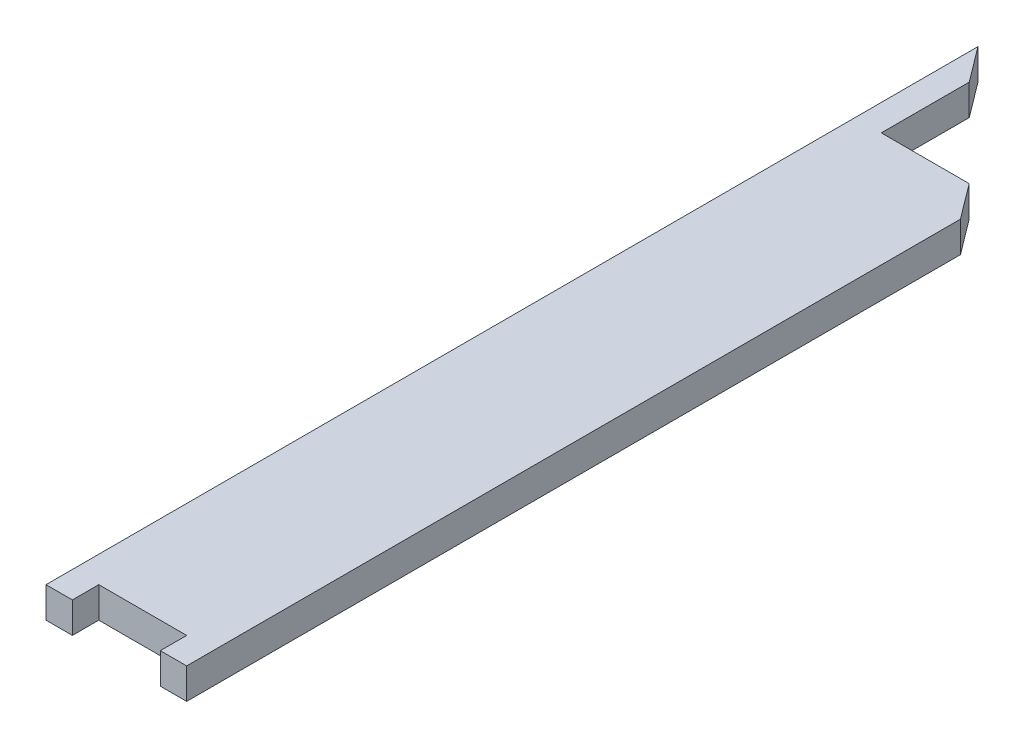
ISO-10303-21;
HEADER;
FILE_DESCRIPTION(('STEP AP214'),'2;1');
FILE_NAME('part.step','',(''),(''),'','','');
FILE_SCHEMA(('AUTOMOTIVE_DESIGN { 1 0 10303 214 1 1 1 1 }'));
ENDSEC;
DATA;
#1=APPLICATION_CONTEXT('core data for automotive mechanical design processes');
#2=APPLICATION_PROTOCOL_DEFINITION('international standard','automotive_design',2000,#1);
#3=PRODUCT_CONTEXT('',#1,'mechanical');
#4=PRODUCT('Part','Part','',(#3));
#5=PRODUCT_RELATED_PRODUCT_CATEGORY('part','',(#4));
#6=PRODUCT_DEFINITION_FORMATION('','',#4);
#7=PRODUCT_DEFINITION_CONTEXT('part definition',#1,'design');
#8=PRODUCT_DEFINITION('design','',#6,#7);
#9=PRODUCT_DEFINITION_SHAPE('','',#8);
#10=(LENGTH_UNIT() NAMED_UNIT(*) SI_UNIT(.MILLI.,.METRE.));
#11=(NAMED_UNIT(*) PLANE_ANGLE_UNIT() SI_UNIT($,.RADIAN.));
#12=(NAMED_UNIT(*) SI_UNIT($,.STERADIAN.) SOLID_ANGLE_UNIT());
#13=UNCERTAINTY_MEASURE_WITH_UNIT(LENGTH_MEASURE(1.E-05),#10,'distance_accuracy_value','');
#14=(GEOMETRIC_REPRESENTATION_CONTEXT(3) GLOBAL_UNCERTAINTY_ASSIGNED_CONTEXT((#13)) GLOBAL_UNIT_ASSIGNED_CONTEXT((#10,
#11,#12)) REPRESENTATION_CONTEXT('',''));
#15=CARTESIAN_POINT('',(0.,0.,0.));
#16=DIRECTION('',(0.,0.,1.));
#17=DIRECTION('',(1.,0.,0.));
#18=AXIS2_PLACEMENT_3D('',#15,#16,#17);
#19=CARTESIAN_POINT('',(-83.3024130010117,70.,-2092.82671227439));
#20=DIRECTION('',(-0.799999999999998,0.,0.600000000000003));
#21=DIRECTION('',(0.600000000000003,0.,0.799999999999998));
#22=AXIS2_PLACEMENT_3D('',#19,#20,#21);
#23=PLANE('',#22);
#24=DIRECTION('',(-0.600000000000003,0.,-0.799999999999998));
#25=VECTOR('',#24,1.);
#26=CARTESIAN_POINT('',(-83.3024130010117,0.,-2092.82671227439));
#27=LINE('',#26,#25);
#28=CARTESIAN_POINT('',(-23.3024130010111,0.,-2012.82671227439));
#29=VERTEX_POINT('',#28);
#30=CARTESIAN_POINT('',(-83.3024130010117,0.,-2092.82671227439));
#31=VERTEX_POINT('',#30);
#32=EDGE_CURVE('E149',#29,#31,#27,.T.);
#33=ORIENTED_EDGE('',*,*,#32,.T.);
#34=DIRECTION('',(0.,-1.,0.));
#35=VECTOR('',#34,1.);
#36=CARTESIAN_POINT('',(-83.3024130010117,70.,-2092.82671227439));
#37=LINE('',#36,#35);
#38=CARTESIAN_POINT('',(-83.3024130010117,70.,-2092.82671227439));
#39=VERTEX_POINT('',#38);
#40=EDGE_CURVE('E11',#39,#31,#37,.T.);
#41=ORIENTED_EDGE('',*,*,#40,.F.);
#42=DIRECTION('',(-0.600000000000003,0.,-0.799999999999998));
#43=VECTOR('',#42,1.);
#44=CARTESIAN_POINT('',(-83.3024130010117,70.,-2092.82671227439));
#45=LINE('',#44,#43);
#46=CARTESIAN_POINT('',(-23.3024130010111,70.,-2012.82671227439));
#47=VERTEX_POINT('',#46);
#48=EDGE_CURVE('E169',#47,#39,#45,.T.);
#49=ORIENTED_EDGE('',*,*,#48,.F.);
#50=DIRECTION('',(0.,-1.,0.));
#51=VECTOR('',#50,1.);
#52=CARTESIAN_POINT('',(-23.3024130010111,70.,-2012.82671227439));
#53=LINE('',#52,#51);
#54=EDGE_CURVE('E145',#47,#29,#53,.T.);
#55=ORIENTED_EDGE('',*,*,#54,.T.);
#56=EDGE_LOOP('',(#33,#41,#49,#55));
#57=FACE_BOUND('',#56,.T.);
#58=ADVANCED_FACE('F35',(#57),#23,.F.);
#59=CARTESIAN_POINT('',(-83.3024130010117,70.,-2092.82671227439));
#60=DIRECTION('',(1.,0.,0.));
#61=DIRECTION('',(0.,0.,-1.));
#62=AXIS2_PLACEMENT_3D('',#59,#60,#61);
#63=PLANE('',#62);
#64=DIRECTION('',(0.,0.,1.));
#65=VECTOR('',#64,1.);
#66=CARTESIAN_POINT('',(-83.3024130010117,0.,-2092.82671227439));
#67=LINE('',#66,#65);
#68=CARTESIAN_POINT('',(-83.3024130010114,0.,27.1732877256143));
#69=VERTEX_POINT('',#68);
#70=EDGE_CURVE('E152',#31,#69,#67,.T.);
#71=ORIENTED_EDGE('',*,*,#70,.T.);
#72=DIRECTION('',(0.,-1.,0.));
#73=VECTOR('',#72,1.);
#74=CARTESIAN_POINT('',(-83.3024130010114,70.,27.1732877256143));
#75=LINE('',#74,#73);
#76=CARTESIAN_POINT('',(-83.3024130010114,70.,27.1732877256143));
#77=VERTEX_POINT('',#76);
#78=EDGE_CURVE('E43',#77,#69,#75,.T.);
#79=ORIENTED_EDGE('',*,*,#78,.F.);
#80=DIRECTION('',(0.,0.,1.));
#81=VECTOR('',#80,1.);
#82=CARTESIAN_POINT('',(-83.3024130010117,70.,-2092.82671227439));
#83=LINE('',#82,#81);
#84=EDGE_CURVE('E103',#39,#77,#83,.T.);
#85=ORIENTED_EDGE('',*,*,#84,.F.);
#86=ORIENTED_EDGE('',*,*,#40,.T.);
#87=EDGE_LOOP('',(#71,#79,#85,#86));
#88=FACE_BOUND('',#87,.T.);
#89=ADVANCED_FACE('F241',(#88),#63,.F.);
#90=CARTESIAN_POINT('',(-83.3024130010114,70.,27.1732877256143));
#91=DIRECTION('',(0.,0.,-1.));
#92=DIRECTION('',(-1.,0.,0.));
#93=AXIS2_PLACEMENT_3D('',#90,#91,#92);
#94=PLANE('',#93);
#95=DIRECTION('',(1.,0.,0.));
#96=VECTOR('',#95,1.);
#97=CARTESIAN_POINT('',(-83.3024130010114,0.,27.1732877256143));
#98=LINE('',#97,#96);
#99=CARTESIAN_POINT('',(-23.3024130010112,0.,27.1732877256144));
#100=VERTEX_POINT('',#99);
#101=EDGE_CURVE('E154',#69,#100,#98,.T.);
#102=ORIENTED_EDGE('',*,*,#101,.T.);
#103=DIRECTION('',(0.,-1.,0.));
#104=VECTOR('',#103,1.);
#105=CARTESIAN_POINT('',(-23.3024130010112,70.,27.1732877256144));
#106=LINE('',#105,#104);
#107=CARTESIAN_POINT('',(-23.3024130010112,70.,27.1732877256144));
#108=VERTEX_POINT('',#107);
#109=EDGE_CURVE('E185',#108,#100,#106,.T.);
#110=ORIENTED_EDGE('',*,*,#109,.F.);
#111=DIRECTION('',(1.,0.,0.));
#112=VECTOR('',#111,1.);
#113=CARTESIAN_POINT('',(-83.3024130010114,70.,27.1732877256143));
#114=LINE('',#113,#112);
#115=EDGE_CURVE('E193',#77,#108,#114,.T.);
#116=ORIENTED_EDGE('',*,*,#115,.F.);
#117=ORIENTED_EDGE('',*,*,#78,.T.);
#118=EDGE_LOOP('',(#102,#110,#116,#117));
#119=FACE_BOUND('',#118,.T.);
#120=ADVANCED_FACE('F191',(#119),#94,.F.);
#121=CARTESIAN_POINT('',(-23.3024130010112,70.,-32.8267122743856));
#122=DIRECTION('',(-1.,0.,0.));
#123=DIRECTION('',(0.,0.,1.));
#124=AXIS2_PLACEMENT_3D('',#121,#122,#123);
#125=PLANE('',#124);
#126=DIRECTION('',(0.,0.,-1.));
#127=VECTOR('',#126,1.);
#128=CARTESIAN_POINT('',(-23.3024130010112,0.,-32.8267122743856));
#129=LINE('',#128,#127);
#130=CARTESIAN_POINT('',(-23.3024130010112,0.,-32.8267122743856));
#131=VERTEX_POINT('',#130);
#132=EDGE_CURVE('E156',#100,#131,#129,.T.);
#133=ORIENTED_EDGE('',*,*,#132,.T.);
#134=DIRECTION('',(0.,-1.,0.));
#135=VECTOR('',#134,1.);
#136=CARTESIAN_POINT('',(-23.3024130010112,70.,-32.8267122743856));
#137=LINE('',#136,#135);
#138=CARTESIAN_POINT('',(-23.3024130010112,70.,-32.8267122743856));
#139=VERTEX_POINT('',#138);
#140=EDGE_CURVE('E182',#139,#131,#137,.T.);
#141=ORIENTED_EDGE('',*,*,#140,.F.);
#142=DIRECTION('',(0.,0.,-1.));
#143=VECTOR('',#142,1.);
#144=CARTESIAN_POINT('',(-23.3024130010112,70.,-32.8267122743856));
#145=LINE('',#144,#143);
#146=EDGE_CURVE('E211',#108,#139,#145,.T.);
#147=ORIENTED_EDGE('',*,*,#146,.F.);
#148=ORIENTED_EDGE('',*,*,#109,.T.);
#149=EDGE_LOOP('',(#133,#141,#147,#148));
#150=FACE_BOUND('',#149,.T.);
#151=ADVANCED_FACE('F202',(#150),#125,.F.);
#152=CARTESIAN_POINT('',(176.697586998989,70.,-32.8267122743856));
#153=DIRECTION('',(0.,0.,-1.));
#154=DIRECTION('',(-1.,0.,0.));
#155=AXIS2_PLACEMENT_3D('',#152,#153,#154);
#156=PLANE('',#155);
#157=DIRECTION('',(1.,0.,0.));
#158=VECTOR('',#157,1.);
#159=CARTESIAN_POINT('',(176.697586998989,0.,-32.8267122743856));
#160=LINE('',#159,#158);
#161=CARTESIAN_POINT('',(176.697586998989,0.,-32.8267122743856));
#162=VERTEX_POINT('',#161);
#163=EDGE_CURVE('E158',#131,#162,#160,.T.);
#164=ORIENTED_EDGE('',*,*,#163,.T.);
#165=DIRECTION('',(0.,-1.,0.));
#166=VECTOR('',#165,1.);
#167=CARTESIAN_POINT('',(176.697586998989,70.,-32.8267122743856));
#168=LINE('',#167,#166);
#169=CARTESIAN_POINT('',(176.697586998989,70.,-32.8267122743856));
#170=VERTEX_POINT('',#169);
#171=EDGE_CURVE('E179',#170,#162,#168,.T.);
#172=ORIENTED_EDGE('',*,*,#171,.F.);
#173=DIRECTION('',(1.,0.,0.));
#174=VECTOR('',#173,1.);
#175=CARTESIAN_POINT('',(176.697586998989,70.,-32.8267122743856));
#176=LINE('',#175,#174);
#177=EDGE_CURVE('E208',#139,#170,#176,.T.);
#178=ORIENTED_EDGE('',*,*,#177,.F.);
#179=ORIENTED_EDGE('',*,*,#140,.T.);
#180=EDGE_LOOP('',(#164,#172,#178,#179));
#181=FACE_BOUND('',#180,.T.);
#182=ADVANCED_FACE('F206',(#181),#156,.F.);
#183=CARTESIAN_POINT('',(176.697586998989,70.,27.1732877256144));
#184=DIRECTION('',(1.,0.,0.));
#185=DIRECTION('',(0.,0.,-1.));
#186=AXIS2_PLACEMENT_3D('',#183,#184,#185);
#187=PLANE('',#186);
#188=DIRECTION('',(0.,0.,1.));
#189=VECTOR('',#188,1.);
#190=CARTESIAN_POINT('',(176.697586998989,0.,27.1732877256144));
#191=LINE('',#190,#189);
#192=CARTESIAN_POINT('',(176.697586998989,0.,27.1732877256144));
#193=VERTEX_POINT('',#192);
#194=EDGE_CURVE('E160',#162,#193,#191,.T.);
#195=ORIENTED_EDGE('',*,*,#194,.T.);
#196=DIRECTION('',(0.,-1.,0.));
#197=VECTOR('',#196,1.);
#198=CARTESIAN_POINT('',(176.697586998989,70.,27.1732877256144));
#199=LINE('',#198,#197);
#200=CARTESIAN_POINT('',(176.697586998989,70.,27.1732877256144));
#201=VERTEX_POINT('',#200);
#202=EDGE_CURVE('E176',#201,#193,#199,.T.);
#203=ORIENTED_EDGE('',*,*,#202,.F.);
#204=DIRECTION('',(0.,0.,1.));
#205=VECTOR('',#204,1.);
#206=CARTESIAN_POINT('',(176.697586998989,70.,27.1732877256144));
#207=LINE('',#206,#205);
#208=EDGE_CURVE('E210',#170,#201,#207,.T.);
#209=ORIENTED_EDGE('',*,*,#208,.F.);
#210=ORIENTED_EDGE('',*,*,#171,.T.);
#211=EDGE_LOOP('',(#195,#203,#209,#210));
#212=FACE_BOUND('',#211,.T.);
#213=ADVANCED_FACE('F254',(#212),#187,.F.);
#214=CARTESIAN_POINT('',(236.697586998989,70.,27.1732877256144));
#215=DIRECTION('',(0.,0.,-1.));
#216=DIRECTION('',(-1.,0.,0.));
#217=AXIS2_PLACEMENT_3D('',#214,#215,#216);
#218=PLANE('',#217);
#219=DIRECTION('',(1.,0.,0.));
#220=VECTOR('',#219,1.);
#221=CARTESIAN_POINT('',(236.697586998989,0.,27.1732877256144));
#222=LINE('',#221,#220);
#223=CARTESIAN_POINT('',(236.697586998989,0.,27.1732877256144));
#224=VERTEX_POINT('',#223);
#225=EDGE_CURVE('E162',#193,#224,#222,.T.);
#226=ORIENTED_EDGE('',*,*,#225,.T.);
#227=DIRECTION('',(0.,-1.,0.));
#228=VECTOR('',#227,1.);
#229=CARTESIAN_POINT('',(236.697586998989,70.,27.1732877256144));
#230=LINE('',#229,#228);
#231=CARTESIAN_POINT('',(236.697586998989,70.,27.1732877256144));
#232=VERTEX_POINT('',#231);
#233=EDGE_CURVE('E173',#232,#224,#230,.T.);
#234=ORIENTED_EDGE('',*,*,#233,.F.);
#235=DIRECTION('',(1.,0.,0.));
#236=VECTOR('',#235,1.);
#237=CARTESIAN_POINT('',(236.697586998989,70.,27.1732877256144));
#238=LINE('',#237,#236);
#239=EDGE_CURVE('E213',#201,#232,#238,.T.);
#240=ORIENTED_EDGE('',*,*,#239,.F.);
#241=ORIENTED_EDGE('',*,*,#202,.T.);
#242=EDGE_LOOP('',(#226,#234,#240,#241));
#243=FACE_BOUND('',#242,.T.);
#244=ADVANCED_FACE('F222',(#243),#218,.F.);
#245=CARTESIAN_POINT('',(236.697586998989,70.,-1732.82671227439));
#246=DIRECTION('',(-1.,0.,0.));
#247=DIRECTION('',(0.,0.,1.));
#248=AXIS2_PLACEMENT_3D('',#245,#246,#247);
#249=PLANE('',#248);
#250=DIRECTION('',(0.,0.,-1.));
#251=VECTOR('',#250,1.);
#252=CARTESIAN_POINT('',(236.697586998989,0.,-1732.82671227439));
#253=LINE('',#252,#251);
#254=CARTESIAN_POINT('',(236.697586998989,0.,-1732.82671227439));
#255=VERTEX_POINT('',#254);
#256=EDGE_CURVE('E164',#224,#255,#253,.T.);
#257=ORIENTED_EDGE('',*,*,#256,.T.);
#258=DIRECTION('',(0.,-1.,0.));
#259=VECTOR('',#258,1.);
#260=CARTESIAN_POINT('',(236.697586998989,70.,-1732.82671227439));
#261=LINE('',#260,#259);
#262=CARTESIAN_POINT('',(236.697586998989,70.,-1732.82671227439));
#263=VERTEX_POINT('',#262);
#264=EDGE_CURVE('E140',#263,#255,#261,.T.);
#265=ORIENTED_EDGE('',*,*,#264,.F.);
#266=DIRECTION('',(0.,0.,-1.));
#267=VECTOR('',#266,1.);
#268=CARTESIAN_POINT('',(236.697586998989,70.,-1732.82671227439));
#269=LINE('',#268,#267);
#270=EDGE_CURVE('E131',#232,#263,#269,.T.);
#271=ORIENTED_EDGE('',*,*,#270,.F.);
#272=ORIENTED_EDGE('',*,*,#233,.T.);
#273=EDGE_LOOP('',(#257,#265,#271,#272));
#274=FACE_BOUND('',#273,.T.);
#275=ADVANCED_FACE('F226',(#274),#249,.F.);
#276=CARTESIAN_POINT('',(236.697586998989,70.,-1732.82671227439));
#277=DIRECTION('',(-0.800000000000001,0.,0.599999999999998));
#278=DIRECTION('',(0.599999999999998,0.,0.800000000000001));
#279=AXIS2_PLACEMENT_3D('',#276,#277,#278);
#280=PLANE('',#279);
#281=DIRECTION('',(-0.599999999999998,0.,-0.800000000000001));
#282=VECTOR('',#281,1.);
#283=CARTESIAN_POINT('',(236.697586998989,0.,-1732.82671227439));
#284=LINE('',#283,#282);
#285=CARTESIAN_POINT('',(176.697586998989,0.,-1812.82671227439));
#286=VERTEX_POINT('',#285);
#287=EDGE_CURVE('E139',#255,#286,#284,.T.);
#288=ORIENTED_EDGE('',*,*,#287,.T.);
#289=DIRECTION('',(0.,-1.,0.));
#290=VECTOR('',#289,1.);
#291=CARTESIAN_POINT('',(176.697586998989,70.,-1812.82671227439));
#292=LINE('',#291,#290);
#293=CARTESIAN_POINT('',(176.697586998989,70.,-1812.82671227439));
#294=VERTEX_POINT('',#293);
#295=EDGE_CURVE('E136',#294,#286,#292,.T.);
#296=ORIENTED_EDGE('',*,*,#295,.F.);
#297=DIRECTION('',(-0.599999999999998,0.,-0.800000000000001));
#298=VECTOR('',#297,1.);
#299=CARTESIAN_POINT('',(236.697586998989,70.,-1732.82671227439));
#300=LINE('',#299,#298);
#301=EDGE_CURVE('E125',#263,#294,#300,.T.);
#302=ORIENTED_EDGE('',*,*,#301,.F.);
#303=ORIENTED_EDGE('',*,*,#264,.T.);
#304=EDGE_LOOP('',(#288,#296,#302,#303));
#305=FACE_BOUND('',#304,.T.);
#306=ADVANCED_FACE('F137',(#305),#280,.F.);
#307=CARTESIAN_POINT('',(-23.3024130010111,70.,-1812.82671227439));
#308=DIRECTION('',(0.,0.,1.));
#309=DIRECTION('',(1.,0.,0.));
#310=AXIS2_PLACEMENT_3D('',#307,#308,#309);
#311=PLANE('',#310);
#312=DIRECTION('',(-1.,0.,0.));
#313=VECTOR('',#312,1.);
#314=CARTESIAN_POINT('',(-23.3024130010111,0.,-1812.82671227439));
#315=LINE('',#314,#313);
#316=CARTESIAN_POINT('',(-23.3024130010111,0.,-1812.82671227439));
#317=VERTEX_POINT('',#316);
#318=EDGE_CURVE('E89',#286,#317,#315,.T.);
#319=ORIENTED_EDGE('',*,*,#318,.T.);
#320=DIRECTION('',(0.,-1.,0.));
#321=VECTOR('',#320,1.);
#322=CARTESIAN_POINT('',(-23.3024130010111,70.,-1812.82671227439));
#323=LINE('',#322,#321);
#324=CARTESIAN_POINT('',(-23.3024130010111,70.,-1812.82671227439));
#325=VERTEX_POINT('',#324);
#326=EDGE_CURVE('E141',#325,#317,#323,.T.);
#327=ORIENTED_EDGE('',*,*,#326,.F.);
#328=DIRECTION('',(-1.,0.,0.));
#329=VECTOR('',#328,1.);
#330=CARTESIAN_POINT('',(-23.3024130010111,70.,-1812.82671227439));
#331=LINE('',#330,#329);
#332=EDGE_CURVE('E129',#294,#325,#331,.T.);
#333=ORIENTED_EDGE('',*,*,#332,.F.);
#334=ORIENTED_EDGE('',*,*,#295,.T.);
#335=EDGE_LOOP('',(#319,#327,#333,#334));
#336=FACE_BOUND('',#335,.T.);
#337=ADVANCED_FACE('F143',(#336),#311,.F.);
#338=CARTESIAN_POINT('',(-23.3024130010111,70.,-2012.82671227439));
#339=DIRECTION('',(-1.,0.,0.));
#340=DIRECTION('',(0.,0.,1.));
#341=AXIS2_PLACEMENT_3D('',#338,#339,#340);
#342=PLANE('',#341);
#343=DIRECTION('',(0.,0.,-1.));
#344=VECTOR('',#343,1.);
#345=CARTESIAN_POINT('',(-23.3024130010111,0.,-2012.82671227439));
#346=LINE('',#345,#344);
#347=EDGE_CURVE('E95',#317,#29,#346,.T.);
#348=ORIENTED_EDGE('',*,*,#347,.T.);
#349=ORIENTED_EDGE('',*,*,#54,.F.);
#350=DIRECTION('',(0.,0.,-1.));
#351=VECTOR('',#350,1.);
#352=CARTESIAN_POINT('',(-23.3024130010111,70.,-2012.82671227439));
#353=LINE('',#352,#351);
#354=EDGE_CURVE('E51',#325,#47,#353,.T.);
#355=ORIENTED_EDGE('',*,*,#354,.F.);
#356=ORIENTED_EDGE('',*,*,#326,.T.);
#357=EDGE_LOOP('',(#348,#349,#355,#356));
#358=FACE_BOUND('',#357,.T.);
#359=ADVANCED_FACE('F230',(#358),#342,.F.);
#360=CARTESIAN_POINT('',(0.,70.,0.));
#361=DIRECTION('',(0.,1.,0.));
#362=DIRECTION('',(0.,0.,1.));
#363=AXIS2_PLACEMENT_3D('',#360,#361,#362);
#364=PLANE('',#363);
#365=ORIENTED_EDGE('',*,*,#48,.T.);
#366=ORIENTED_EDGE('',*,*,#84,.T.);
#367=ORIENTED_EDGE('',*,*,#115,.T.);
#368=ORIENTED_EDGE('',*,*,#146,.T.);
#369=ORIENTED_EDGE('',*,*,#177,.T.);
#370=ORIENTED_EDGE('',*,*,#208,.T.);
#371=ORIENTED_EDGE('',*,*,#239,.T.);
#372=ORIENTED_EDGE('',*,*,#270,.T.);
#373=ORIENTED_EDGE('',*,*,#301,.T.);
#374=ORIENTED_EDGE('',*,*,#332,.T.);
#375=ORIENTED_EDGE('',*,*,#354,.T.);
#376=EDGE_LOOP('',(#365,#366,#367,#368,#369,#370,#371,#372,#373,#374,#375));
#377=FACE_BOUND('',#376,.T.);
#378=ADVANCED_FACE('F127',(#377),#364,.T.);
#379=CARTESIAN_POINT('',(0.,0.,0.));
#380=DIRECTION('',(0.,1.,0.));
#381=DIRECTION('',(0.,0.,1.));
#382=AXIS2_PLACEMENT_3D('',#379,#380,#381);
#383=PLANE('',#382);
#384=ORIENTED_EDGE('',*,*,#32,.F.);
#385=ORIENTED_EDGE('',*,*,#347,.F.);
#386=ORIENTED_EDGE('',*,*,#318,.F.);
#387=ORIENTED_EDGE('',*,*,#287,.F.);
#388=ORIENTED_EDGE('',*,*,#256,.F.);
#389=ORIENTED_EDGE('',*,*,#225,.F.);
#390=ORIENTED_EDGE('',*,*,#194,.F.);
#391=ORIENTED_EDGE('',*,*,#163,.F.);
#392=ORIENTED_EDGE('',*,*,#132,.F.);
#393=ORIENTED_EDGE('',*,*,#101,.F.);
#394=ORIENTED_EDGE('',*,*,#70,.F.);
#395=EDGE_LOOP('',(#384,#385,#386,#387,#388,#389,#390,#391,#392,#393,#394));
#396=FACE_BOUND('',#395,.T.);
#397=ADVANCED_FACE('F197',(#396),#383,.F.);
#398=CLOSED_SHELL('',(#58,#89,#120,#151,#182,#213,#244,#275,#306,#337,#359,#378,#397));
#399=MANIFOLD_SOLID_BREP('B2',#398);
#400=ADVANCED_BREP_SHAPE_REPRESENTATION('',(#18,#399),#14);
#401=SHAPE_DEFINITION_REPRESENTATION(#9,#400);
ENDSEC;
END-ISO-10303-21;
